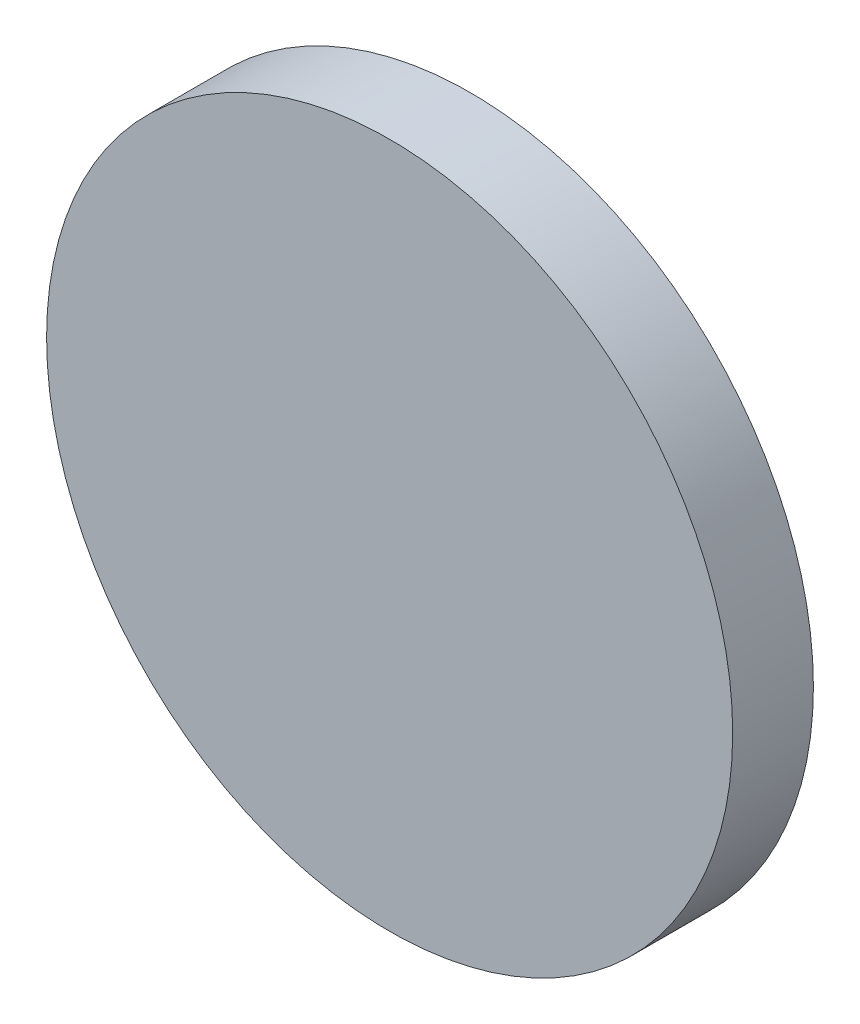
ISO-10303-21;
HEADER;
FILE_DESCRIPTION(('STEP AP214'),'2;1');
FILE_NAME('part.step','',(''),(''),'','','');
FILE_SCHEMA(('AUTOMOTIVE_DESIGN { 1 0 10303 214 1 1 1 1 }'));
ENDSEC;
DATA;
#1=APPLICATION_CONTEXT('core data for automotive mechanical design processes');
#2=APPLICATION_PROTOCOL_DEFINITION('international standard','automotive_design',2000,#1);
#3=PRODUCT_CONTEXT('',#1,'mechanical');
#4=PRODUCT('Part','Part','',(#3));
#5=PRODUCT_RELATED_PRODUCT_CATEGORY('part','',(#4));
#6=PRODUCT_DEFINITION_FORMATION('','',#4);
#7=PRODUCT_DEFINITION_CONTEXT('part definition',#1,'design');
#8=PRODUCT_DEFINITION('design','',#6,#7);
#9=PRODUCT_DEFINITION_SHAPE('','',#8);
#10=(LENGTH_UNIT() NAMED_UNIT(*) SI_UNIT(.MILLI.,.METRE.));
#11=(NAMED_UNIT(*) PLANE_ANGLE_UNIT() SI_UNIT($,.RADIAN.));
#12=(NAMED_UNIT(*) SI_UNIT($,.STERADIAN.) SOLID_ANGLE_UNIT());
#13=UNCERTAINTY_MEASURE_WITH_UNIT(LENGTH_MEASURE(1.E-05),#10,'distance_accuracy_value','');
#14=(GEOMETRIC_REPRESENTATION_CONTEXT(3) GLOBAL_UNCERTAINTY_ASSIGNED_CONTEXT((#13)) GLOBAL_UNIT_ASSIGNED_CONTEXT((#10,
#11,#12)) REPRESENTATION_CONTEXT('',''));
#15=CARTESIAN_POINT('',(0.,0.,0.));
#16=DIRECTION('',(0.,0.,1.));
#17=DIRECTION('',(1.,0.,0.));
#18=AXIS2_PLACEMENT_3D('',#15,#16,#17);
#19=CARTESIAN_POINT('',(0.85000084,0.,0.1999996));
#20=DIRECTION('',(0.,0.,-1.));
#21=DIRECTION('',(0.,-1.,0.));
#22=AXIS2_PLACEMENT_3D('',#19,#20,#21);
#23=PLANE('',#22);
#24=CARTESIAN_POINT('',(0.,0.,0.1999996));
#25=DIRECTION('',(0.,0.,1.));
#26=DIRECTION('',(1.,0.,0.));
#27=AXIS2_PLACEMENT_3D('',#24,#25,#26);
#28=CIRCLE('',#27,0.85000084);
#29=CARTESIAN_POINT('',(-0.85000084,0.,0.1999996));
#30=VERTEX_POINT('',#29);
#31=EDGE_CURVE('E11',#30,#30,#28,.T.);
#32=ORIENTED_EDGE('',*,*,#31,.T.);
#33=EDGE_LOOP('',(#32));
#34=FACE_BOUND('',#33,.T.);
#35=ADVANCED_FACE('F17',(#34),#23,.F.);
#36=CARTESIAN_POINT('',(0.85000084,0.,0.));
#37=DIRECTION('',(0.,0.,-1.));
#38=DIRECTION('',(0.,-1.,0.));
#39=AXIS2_PLACEMENT_3D('',#36,#37,#38);
#40=PLANE('',#39);
#41=CARTESIAN_POINT('',(0.,0.,0.));
#42=DIRECTION('',(0.,0.,1.));
#43=DIRECTION('',(1.,0.,0.));
#44=AXIS2_PLACEMENT_3D('',#41,#42,#43);
#45=CIRCLE('',#44,0.85000084);
#46=CARTESIAN_POINT('',(-0.85000084,0.,0.));
#47=VERTEX_POINT('',#46);
#48=EDGE_CURVE('E44',#47,#47,#45,.T.);
#49=ORIENTED_EDGE('',*,*,#48,.F.);
#50=EDGE_LOOP('',(#49));
#51=FACE_BOUND('',#50,.T.);
#52=ADVANCED_FACE('F19',(#51),#40,.T.);
#53=CARTESIAN_POINT('',(0.,0.,0.));
#54=DIRECTION('',(0.,0.,-1.));
#55=DIRECTION('',(1.,0.,0.));
#56=AXIS2_PLACEMENT_3D('',#53,#54,#55);
#57=CYLINDRICAL_SURFACE('',#56,0.85000084);
#58=ORIENTED_EDGE('',*,*,#48,.T.);
#59=DIRECTION('',(0.,0.,1.));
#60=VECTOR('',#59,1.);
#61=CARTESIAN_POINT('',(-0.85000084,0.,0.));
#62=LINE('',#61,#60);
#63=EDGE_CURVE('E21',#47,#30,#62,.T.);
#64=ORIENTED_EDGE('',*,*,#63,.T.);
#65=ORIENTED_EDGE('',*,*,#31,.F.);
#66=ORIENTED_EDGE('',*,*,#63,.F.);
#67=EDGE_LOOP('',(#58,#64,#65,#66));
#68=FACE_BOUND('',#67,.T.);
#69=ADVANCED_FACE('F42',(#68),#57,.T.);
#70=CLOSED_SHELL('',(#35,#52,#69));
#71=MANIFOLD_SOLID_BREP('B1',#70);
#72=ADVANCED_BREP_SHAPE_REPRESENTATION('',(#18,#71),#14);
#73=SHAPE_DEFINITION_REPRESENTATION(#9,#72);
ENDSEC;
END-ISO-10303-21;
